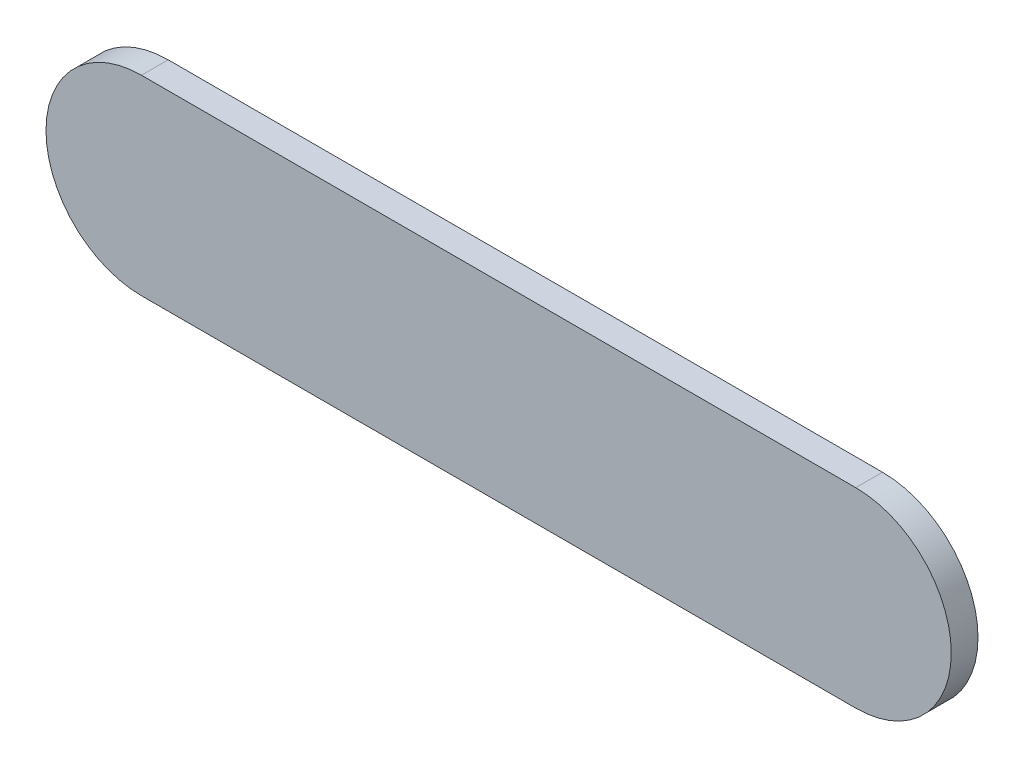
ISO-10303-21;
HEADER;
FILE_DESCRIPTION(('STEP AP214'),'2;1');
FILE_NAME('part.step','',(''),(''),'','','');
FILE_SCHEMA(('AUTOMOTIVE_DESIGN { 1 0 10303 214 1 1 1 1 }'));
ENDSEC;
DATA;
#1=APPLICATION_CONTEXT('core data for automotive mechanical design processes');
#2=APPLICATION_PROTOCOL_DEFINITION('international standard','automotive_design',2000,#1);
#3=PRODUCT_CONTEXT('',#1,'mechanical');
#4=PRODUCT('Part','Part','',(#3));
#5=PRODUCT_RELATED_PRODUCT_CATEGORY('part','',(#4));
#6=PRODUCT_DEFINITION_FORMATION('','',#4);
#7=PRODUCT_DEFINITION_CONTEXT('part definition',#1,'design');
#8=PRODUCT_DEFINITION('design','',#6,#7);
#9=PRODUCT_DEFINITION_SHAPE('','',#8);
#10=(LENGTH_UNIT() NAMED_UNIT(*) SI_UNIT(.MILLI.,.METRE.));
#11=(NAMED_UNIT(*) PLANE_ANGLE_UNIT() SI_UNIT($,.RADIAN.));
#12=(NAMED_UNIT(*) SI_UNIT($,.STERADIAN.) SOLID_ANGLE_UNIT());
#13=UNCERTAINTY_MEASURE_WITH_UNIT(LENGTH_MEASURE(1.E-05),#10,'distance_accuracy_value','');
#14=(GEOMETRIC_REPRESENTATION_CONTEXT(3) GLOBAL_UNCERTAINTY_ASSIGNED_CONTEXT((#13)) GLOBAL_UNIT_ASSIGNED_CONTEXT((#10,
#11,#12)) REPRESENTATION_CONTEXT('',''));
#15=CARTESIAN_POINT('',(0.,0.,0.));
#16=DIRECTION('',(0.,0.,1.));
#17=DIRECTION('',(1.,0.,0.));
#18=AXIS2_PLACEMENT_3D('',#15,#16,#17);
#19=CARTESIAN_POINT('',(97.3170012,84.0599284,0.));
#20=DIRECTION('',(0.,1.,0.));
#21=DIRECTION('',(1.,0.,0.));
#22=AXIS2_PLACEMENT_3D('',#19,#20,#21);
#23=PLANE('',#22);
#24=DIRECTION('',(1.,0.,0.));
#25=VECTOR('',#24,1.);
#26=CARTESIAN_POINT('',(97.3170012,84.0599284,0.03556));
#27=LINE('',#26,#25);
#28=CARTESIAN_POINT('',(97.3170012,84.0599284,0.03556));
#29=VERTEX_POINT('',#28);
#30=CARTESIAN_POINT('',(98.267012,84.0599284,0.03556));
#31=VERTEX_POINT('',#30);
#32=EDGE_CURVE('E11',#29,#31,#27,.T.);
#33=ORIENTED_EDGE('',*,*,#32,.F.);
#34=DIRECTION('',(0.,0.,1.));
#35=VECTOR('',#34,1.);
#36=CARTESIAN_POINT('',(97.3170012,84.0599284,0.));
#37=LINE('',#36,#35);
#38=CARTESIAN_POINT('',(97.3170012,84.0599284,0.));
#39=VERTEX_POINT('',#38);
#40=EDGE_CURVE('E24',#39,#29,#37,.T.);
#41=ORIENTED_EDGE('',*,*,#40,.F.);
#42=DIRECTION('',(1.,0.,0.));
#43=VECTOR('',#42,1.);
#44=CARTESIAN_POINT('',(97.3170012,84.0599284,0.));
#45=LINE('',#44,#43);
#46=CARTESIAN_POINT('',(98.267012,84.0599284,0.));
#47=VERTEX_POINT('',#46);
#48=EDGE_CURVE('E75',#39,#47,#45,.T.);
#49=ORIENTED_EDGE('',*,*,#48,.T.);
#50=DIRECTION('',(0.,0.,1.));
#51=VECTOR('',#50,1.);
#52=CARTESIAN_POINT('',(98.267012,84.0599284,0.));
#53=LINE('',#52,#51);
#54=EDGE_CURVE('E37',#47,#31,#53,.T.);
#55=ORIENTED_EDGE('',*,*,#54,.T.);
#56=EDGE_LOOP('',(#33,#41,#49,#55));
#57=FACE_BOUND('',#56,.T.);
#58=ADVANCED_FACE('F17',(#57),#23,.F.);
#59=CARTESIAN_POINT('',(98.267012,84.1869284,0.));
#60=DIRECTION('',(0.,0.,-1.));
#61=DIRECTION('',(0.,-1.,0.));
#62=AXIS2_PLACEMENT_3D('',#59,#60,#61);
#63=CYLINDRICAL_SURFACE('',#62,0.127);
#64=CARTESIAN_POINT('',(98.267012,84.1869284,0.03556));
#65=DIRECTION('',(0.,0.,1.));
#66=DIRECTION('',(0.,-1.,0.));
#67=AXIS2_PLACEMENT_3D('',#64,#65,#66);
#68=CIRCLE('',#67,0.127);
#69=CARTESIAN_POINT('',(98.267012,84.3139284,0.03556));
#70=VERTEX_POINT('',#69);
#71=EDGE_CURVE('E83',#31,#70,#68,.T.);
#72=ORIENTED_EDGE('',*,*,#71,.F.);
#73=ORIENTED_EDGE('',*,*,#54,.F.);
#74=CARTESIAN_POINT('',(98.267012,84.1869284,0.));
#75=DIRECTION('',(0.,0.,1.));
#76=DIRECTION('',(0.,-1.,0.));
#77=AXIS2_PLACEMENT_3D('',#74,#75,#76);
#78=CIRCLE('',#77,0.127);
#79=CARTESIAN_POINT('',(98.267012,84.3139284,0.));
#80=VERTEX_POINT('',#79);
#81=EDGE_CURVE('E81',#47,#80,#78,.T.);
#82=ORIENTED_EDGE('',*,*,#81,.T.);
#83=DIRECTION('',(0.,0.,1.));
#84=VECTOR('',#83,1.);
#85=CARTESIAN_POINT('',(98.267012,84.3139284,0.));
#86=LINE('',#85,#84);
#87=EDGE_CURVE('E67',#80,#70,#86,.T.);
#88=ORIENTED_EDGE('',*,*,#87,.T.);
#89=EDGE_LOOP('',(#72,#73,#82,#88));
#90=FACE_BOUND('',#89,.T.);
#91=ADVANCED_FACE('F89',(#90),#63,.T.);
#92=CARTESIAN_POINT('',(98.267012,84.3139284,0.));
#93=DIRECTION('',(0.,-1.,0.));
#94=DIRECTION('',(-1.,0.,0.));
#95=AXIS2_PLACEMENT_3D('',#92,#93,#94);
#96=PLANE('',#95);
#97=DIRECTION('',(-1.,0.,0.));
#98=VECTOR('',#97,1.);
#99=CARTESIAN_POINT('',(98.267012,84.3139284,0.03556));
#100=LINE('',#99,#98);
#101=CARTESIAN_POINT('',(97.3170012,84.3139284,0.03556));
#102=VERTEX_POINT('',#101);
#103=EDGE_CURVE('E71',#70,#102,#100,.T.);
#104=ORIENTED_EDGE('',*,*,#103,.F.);
#105=ORIENTED_EDGE('',*,*,#87,.F.);
#106=DIRECTION('',(-1.,0.,0.));
#107=VECTOR('',#106,1.);
#108=CARTESIAN_POINT('',(98.267012,84.3139284,0.));
#109=LINE('',#108,#107);
#110=CARTESIAN_POINT('',(97.3170012,84.3139284,0.));
#111=VERTEX_POINT('',#110);
#112=EDGE_CURVE('E63',#80,#111,#109,.T.);
#113=ORIENTED_EDGE('',*,*,#112,.T.);
#114=DIRECTION('',(0.,0.,1.));
#115=VECTOR('',#114,1.);
#116=CARTESIAN_POINT('',(97.3170012,84.3139284,0.));
#117=LINE('',#116,#115);
#118=EDGE_CURVE('E53',#111,#102,#117,.T.);
#119=ORIENTED_EDGE('',*,*,#118,.T.);
#120=EDGE_LOOP('',(#104,#105,#113,#119));
#121=FACE_BOUND('',#120,.T.);
#122=ADVANCED_FACE('F66',(#121),#96,.F.);
#123=CARTESIAN_POINT('',(97.3170012,84.1869284,0.));
#124=DIRECTION('',(0.,0.,-1.));
#125=DIRECTION('',(0.,1.,0.));
#126=AXIS2_PLACEMENT_3D('',#123,#124,#125);
#127=CYLINDRICAL_SURFACE('',#126,0.126999999999995);
#128=CARTESIAN_POINT('',(97.3170012,84.1869284,0.03556));
#129=DIRECTION('',(0.,0.,1.));
#130=DIRECTION('',(0.,1.,0.));
#131=AXIS2_PLACEMENT_3D('',#128,#129,#130);
#132=CIRCLE('',#131,0.126999999999995);
#133=EDGE_CURVE('E59',#102,#29,#132,.T.);
#134=ORIENTED_EDGE('',*,*,#133,.F.);
#135=ORIENTED_EDGE('',*,*,#118,.F.);
#136=CARTESIAN_POINT('',(97.3170012,84.1869284,0.));
#137=DIRECTION('',(0.,0.,1.));
#138=DIRECTION('',(0.,1.,0.));
#139=AXIS2_PLACEMENT_3D('',#136,#137,#138);
#140=CIRCLE('',#139,0.126999999999995);
#141=EDGE_CURVE('E57',#111,#39,#140,.T.);
#142=ORIENTED_EDGE('',*,*,#141,.T.);
#143=ORIENTED_EDGE('',*,*,#40,.T.);
#144=EDGE_LOOP('',(#134,#135,#142,#143));
#145=FACE_BOUND('',#144,.T.);
#146=ADVANCED_FACE('F55',(#145),#127,.T.);
#147=CARTESIAN_POINT('',(97.3170012,84.0599284,0.));
#148=DIRECTION('',(0.,0.,-1.));
#149=DIRECTION('',(-1.,0.,0.));
#150=AXIS2_PLACEMENT_3D('',#147,#148,#149);
#151=PLANE('',#150);
#152=ORIENTED_EDGE('',*,*,#141,.F.);
#153=ORIENTED_EDGE('',*,*,#112,.F.);
#154=ORIENTED_EDGE('',*,*,#81,.F.);
#155=ORIENTED_EDGE('',*,*,#48,.F.);
#156=EDGE_LOOP('',(#152,#153,#154,#155));
#157=FACE_BOUND('',#156,.T.);
#158=ADVANCED_FACE('F74',(#157),#151,.T.);
#159=CARTESIAN_POINT('',(97.3170012,84.0599284,0.03556));
#160=DIRECTION('',(0.,0.,-1.));
#161=DIRECTION('',(-1.,0.,0.));
#162=AXIS2_PLACEMENT_3D('',#159,#160,#161);
#163=PLANE('',#162);
#164=ORIENTED_EDGE('',*,*,#32,.T.);
#165=ORIENTED_EDGE('',*,*,#71,.T.);
#166=ORIENTED_EDGE('',*,*,#103,.T.);
#167=ORIENTED_EDGE('',*,*,#133,.T.);
#168=EDGE_LOOP('',(#164,#165,#166,#167));
#169=FACE_BOUND('',#168,.T.);
#170=ADVANCED_FACE('F91',(#169),#163,.F.);
#171=CLOSED_SHELL('',(#58,#91,#122,#146,#158,#170));
#172=MANIFOLD_SOLID_BREP('B1',#171);
#173=ADVANCED_BREP_SHAPE_REPRESENTATION('',(#18,#172),#14);
#174=SHAPE_DEFINITION_REPRESENTATION(#9,#173);
ENDSEC;
END-ISO-10303-21;
